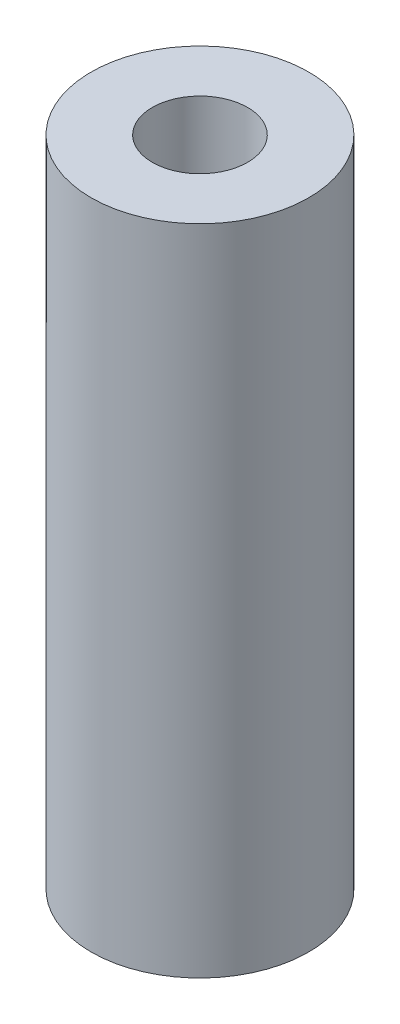
ISO-10303-21;
HEADER;
FILE_DESCRIPTION(('STEP AP214'),'2;1');
FILE_NAME('part.step','',(''),(''),'','','');
FILE_SCHEMA(('AUTOMOTIVE_DESIGN { 1 0 10303 214 1 1 1 1 }'));
ENDSEC;
DATA;
#1=APPLICATION_CONTEXT('core data for automotive mechanical design processes');
#2=APPLICATION_PROTOCOL_DEFINITION('international standard','automotive_design',2000,#1);
#3=PRODUCT_CONTEXT('',#1,'mechanical');
#4=PRODUCT('Part','Part','',(#3));
#5=PRODUCT_RELATED_PRODUCT_CATEGORY('part','',(#4));
#6=PRODUCT_DEFINITION_FORMATION('','',#4);
#7=PRODUCT_DEFINITION_CONTEXT('part definition',#1,'design');
#8=PRODUCT_DEFINITION('design','',#6,#7);
#9=PRODUCT_DEFINITION_SHAPE('','',#8);
#10=(LENGTH_UNIT() NAMED_UNIT(*) SI_UNIT(.MILLI.,.METRE.));
#11=(NAMED_UNIT(*) PLANE_ANGLE_UNIT() SI_UNIT($,.RADIAN.));
#12=(NAMED_UNIT(*) SI_UNIT($,.STERADIAN.) SOLID_ANGLE_UNIT());
#13=UNCERTAINTY_MEASURE_WITH_UNIT(LENGTH_MEASURE(1.E-05),#10,'distance_accuracy_value','');
#14=(GEOMETRIC_REPRESENTATION_CONTEXT(3) GLOBAL_UNCERTAINTY_ASSIGNED_CONTEXT((#13)) GLOBAL_UNIT_ASSIGNED_CONTEXT((#10,
#11,#12)) REPRESENTATION_CONTEXT('',''));
#15=CARTESIAN_POINT('',(0.,0.,0.));
#16=DIRECTION('',(0.,0.,1.));
#17=DIRECTION('',(1.,0.,0.));
#18=AXIS2_PLACEMENT_3D('',#15,#16,#17);
#19=CARTESIAN_POINT('',(0.,12.,0.));
#20=DIRECTION('',(0.,-1.,0.));
#21=DIRECTION('',(0.,0.,-1.));
#22=AXIS2_PLACEMENT_3D('',#19,#20,#21);
#23=CYLINDRICAL_SURFACE('',#22,2.);
#24=CARTESIAN_POINT('',(0.,12.,0.));
#25=DIRECTION('',(0.,1.,0.));
#26=DIRECTION('',(0.,0.,1.));
#27=AXIS2_PLACEMENT_3D('',#24,#25,#26);
#28=CIRCLE('',#27,2.);
#29=CARTESIAN_POINT('',(0.,12.,2.));
#30=VERTEX_POINT('',#29);
#31=EDGE_CURVE('E10',#30,#30,#28,.T.);
#32=ORIENTED_EDGE('',*,*,#31,.F.);
#33=EDGE_LOOP('',(#32));
#34=FACE_BOUND('',#33,.T.);
#35=CARTESIAN_POINT('',(0.,0.,0.));
#36=DIRECTION('',(0.,1.,0.));
#37=DIRECTION('',(0.,0.,1.));
#38=AXIS2_PLACEMENT_3D('',#35,#36,#37);
#39=CIRCLE('',#38,2.);
#40=CARTESIAN_POINT('',(0.,0.,2.));
#41=VERTEX_POINT('',#40);
#42=EDGE_CURVE('E38',#41,#41,#39,.T.);
#43=ORIENTED_EDGE('',*,*,#42,.T.);
#44=EDGE_LOOP('',(#43));
#45=FACE_BOUND('',#44,.T.);
#46=ADVANCED_FACE('F35',(#34,#45),#23,.T.);
#47=CARTESIAN_POINT('',(0.,12.,0.));
#48=DIRECTION('',(0.,1.,0.));
#49=DIRECTION('',(0.,0.,1.));
#50=AXIS2_PLACEMENT_3D('',#47,#48,#49);
#51=PLANE('',#50);
#52=CARTESIAN_POINT('',(0.,12.,0.));
#53=DIRECTION('',(0.,1.,0.));
#54=DIRECTION('',(0.,0.,1.));
#55=AXIS2_PLACEMENT_3D('',#52,#53,#54);
#56=CIRCLE('',#55,0.875);
#57=CARTESIAN_POINT('',(0.,12.,0.875));
#58=VERTEX_POINT('',#57);
#59=EDGE_CURVE('E50',#58,#58,#56,.T.);
#60=ORIENTED_EDGE('',*,*,#59,.F.);
#61=EDGE_LOOP('',(#60));
#62=FACE_BOUND('',#61,.T.);
#63=ORIENTED_EDGE('',*,*,#31,.T.);
#64=EDGE_LOOP('',(#63));
#65=FACE_BOUND('',#64,.T.);
#66=ADVANCED_FACE('F66',(#62,#65),#51,.T.);
#67=CARTESIAN_POINT('',(0.,0.,0.));
#68=DIRECTION('',(0.,1.,0.));
#69=DIRECTION('',(0.,0.,1.));
#70=AXIS2_PLACEMENT_3D('',#67,#68,#69);
#71=PLANE('',#70);
#72=CARTESIAN_POINT('',(0.,0.,0.));
#73=DIRECTION('',(0.,1.,0.));
#74=DIRECTION('',(0.,0.,1.));
#75=AXIS2_PLACEMENT_3D('',#72,#73,#74);
#76=CIRCLE('',#75,0.875);
#77=CARTESIAN_POINT('',(0.,0.,0.875));
#78=VERTEX_POINT('',#77);
#79=EDGE_CURVE('E48',#78,#78,#76,.T.);
#80=ORIENTED_EDGE('',*,*,#79,.T.);
#81=EDGE_LOOP('',(#80));
#82=FACE_BOUND('',#81,.T.);
#83=ORIENTED_EDGE('',*,*,#42,.F.);
#84=EDGE_LOOP('',(#83));
#85=FACE_BOUND('',#84,.T.);
#86=ADVANCED_FACE('F57',(#82,#85),#71,.F.);
#87=CARTESIAN_POINT('',(0.,0.,0.));
#88=DIRECTION('',(0.,1.,0.));
#89=DIRECTION('',(0.,0.,1.));
#90=AXIS2_PLACEMENT_3D('',#87,#88,#89);
#91=CYLINDRICAL_SURFACE('',#90,0.875);
#92=ORIENTED_EDGE('',*,*,#79,.F.);
#93=EDGE_LOOP('',(#92));
#94=FACE_BOUND('',#93,.T.);
#95=ORIENTED_EDGE('',*,*,#59,.T.);
#96=EDGE_LOOP('',(#95));
#97=FACE_BOUND('',#96,.T.);
#98=ADVANCED_FACE('F60',(#94,#97),#91,.F.);
#99=CLOSED_SHELL('',(#46,#66,#86,#98));
#100=MANIFOLD_SOLID_BREP('B2',#99);
#101=ADVANCED_BREP_SHAPE_REPRESENTATION('',(#18,#100),#14);
#102=SHAPE_DEFINITION_REPRESENTATION(#9,#101);
ENDSEC;
END-ISO-10303-21;
